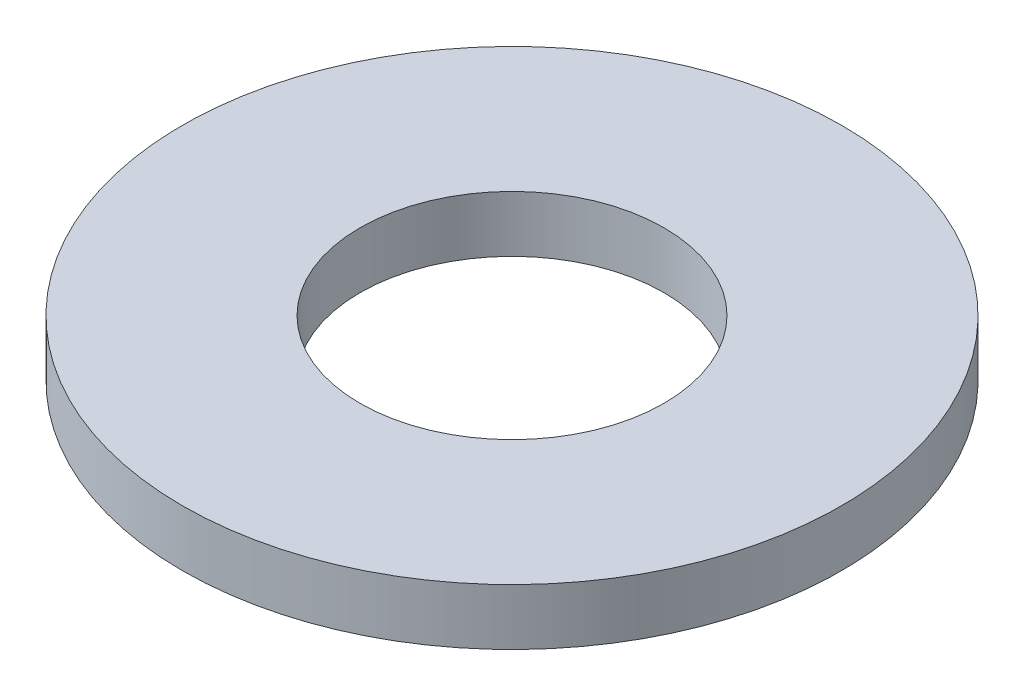
ISO-10303-21;
HEADER;
FILE_DESCRIPTION(('STEP AP214'),'2;1');
FILE_NAME('part.step','',(''),(''),'','','');
FILE_SCHEMA(('AUTOMOTIVE_DESIGN { 1 0 10303 214 1 1 1 1 }'));
ENDSEC;
DATA;
#1=APPLICATION_CONTEXT('core data for automotive mechanical design processes');
#2=APPLICATION_PROTOCOL_DEFINITION('international standard','automotive_design',2000,#1);
#3=PRODUCT_CONTEXT('',#1,'mechanical');
#4=PRODUCT('Part','Part','',(#3));
#5=PRODUCT_RELATED_PRODUCT_CATEGORY('part','',(#4));
#6=PRODUCT_DEFINITION_FORMATION('','',#4);
#7=PRODUCT_DEFINITION_CONTEXT('part definition',#1,'design');
#8=PRODUCT_DEFINITION('design','',#6,#7);
#9=PRODUCT_DEFINITION_SHAPE('','',#8);
#10=(LENGTH_UNIT() NAMED_UNIT(*) SI_UNIT(.MILLI.,.METRE.));
#11=(NAMED_UNIT(*) PLANE_ANGLE_UNIT() SI_UNIT($,.RADIAN.));
#12=(NAMED_UNIT(*) SI_UNIT($,.STERADIAN.) SOLID_ANGLE_UNIT());
#13=UNCERTAINTY_MEASURE_WITH_UNIT(LENGTH_MEASURE(1.E-05),#10,'distance_accuracy_value','');
#14=(GEOMETRIC_REPRESENTATION_CONTEXT(3) GLOBAL_UNCERTAINTY_ASSIGNED_CONTEXT((#13)) GLOBAL_UNIT_ASSIGNED_CONTEXT((#10,
#11,#12)) REPRESENTATION_CONTEXT('',''));
#15=CARTESIAN_POINT('',(0.,0.,0.));
#16=DIRECTION('',(0.,0.,1.));
#17=DIRECTION('',(1.,0.,0.));
#18=AXIS2_PLACEMENT_3D('',#15,#16,#17);
#19=CARTESIAN_POINT('',(0.,0.8128,0.));
#20=DIRECTION('',(0.,1.,0.));
#21=DIRECTION('',(0.,0.,1.));
#22=AXIS2_PLACEMENT_3D('',#19,#20,#21);
#23=PLANE('',#22);
#24=CARTESIAN_POINT('',(0.,0.8128,0.));
#25=DIRECTION('',(0.,-1.,0.));
#26=DIRECTION('',(0.,0.,-1.));
#27=AXIS2_PLACEMENT_3D('',#24,#25,#26);
#28=CIRCLE('',#27,2.1971);
#29=CARTESIAN_POINT('',(0.,0.8128,-2.1971));
#30=VERTEX_POINT('',#29);
#31=EDGE_CURVE('E25',#30,#30,#28,.T.);
#32=ORIENTED_EDGE('',*,*,#31,.T.);
#33=EDGE_LOOP('',(#32));
#34=FACE_BOUND('',#33,.T.);
#35=CARTESIAN_POINT('',(0.,0.8128,0.));
#36=DIRECTION('',(0.,-1.,0.));
#37=DIRECTION('',(0.,0.,-1.));
#38=AXIS2_PLACEMENT_3D('',#35,#36,#37);
#39=CIRCLE('',#38,4.7625);
#40=CARTESIAN_POINT('',(0.,0.8128,-4.7625));
#41=VERTEX_POINT('',#40);
#42=EDGE_CURVE('E16',#41,#41,#39,.T.);
#43=ORIENTED_EDGE('',*,*,#42,.F.);
#44=EDGE_LOOP('',(#43));
#45=FACE_BOUND('',#44,.T.);
#46=ADVANCED_FACE('F12',(#34,#45),#23,.T.);
#47=CARTESIAN_POINT('',(0.,0.8128,0.));
#48=DIRECTION('',(0.,-1.,0.));
#49=DIRECTION('',(0.,0.,-1.));
#50=AXIS2_PLACEMENT_3D('',#47,#48,#49);
#51=CYLINDRICAL_SURFACE('',#50,4.7625);
#52=ORIENTED_EDGE('',*,*,#42,.T.);
#53=EDGE_LOOP('',(#52));
#54=FACE_BOUND('',#53,.T.);
#55=CARTESIAN_POINT('',(0.,0.,0.));
#56=DIRECTION('',(0.,-1.,0.));
#57=DIRECTION('',(0.,0.,-1.));
#58=AXIS2_PLACEMENT_3D('',#55,#56,#57);
#59=CIRCLE('',#58,4.7625);
#60=CARTESIAN_POINT('',(0.,0.,-4.7625));
#61=VERTEX_POINT('',#60);
#62=EDGE_CURVE('E20',#61,#61,#59,.F.);
#63=ORIENTED_EDGE('',*,*,#62,.T.);
#64=EDGE_LOOP('',(#63));
#65=FACE_BOUND('',#64,.T.);
#66=ADVANCED_FACE('F33',(#54,#65),#51,.T.);
#67=CARTESIAN_POINT('',(0.,0.8128,0.));
#68=DIRECTION('',(0.,-1.,0.));
#69=DIRECTION('',(0.,0.,-1.));
#70=AXIS2_PLACEMENT_3D('',#67,#68,#69);
#71=CYLINDRICAL_SURFACE('',#70,2.1971);
#72=CARTESIAN_POINT('',(0.,0.,0.));
#73=DIRECTION('',(0.,-1.,0.));
#74=DIRECTION('',(0.,0.,-1.));
#75=AXIS2_PLACEMENT_3D('',#72,#73,#74);
#76=CIRCLE('',#75,2.1971);
#77=CARTESIAN_POINT('',(0.,0.,-2.1971));
#78=VERTEX_POINT('',#77);
#79=EDGE_CURVE('E8',#78,#78,#76,.T.);
#80=ORIENTED_EDGE('',*,*,#79,.T.);
#81=EDGE_LOOP('',(#80));
#82=FACE_BOUND('',#81,.T.);
#83=ORIENTED_EDGE('',*,*,#31,.F.);
#84=EDGE_LOOP('',(#83));
#85=FACE_BOUND('',#84,.T.);
#86=ADVANCED_FACE('F42',(#82,#85),#71,.F.);
#87=CARTESIAN_POINT('',(0.,0.,0.));
#88=DIRECTION('',(0.,1.,0.));
#89=DIRECTION('',(0.,0.,1.));
#90=AXIS2_PLACEMENT_3D('',#87,#88,#89);
#91=PLANE('',#90);
#92=ORIENTED_EDGE('',*,*,#79,.F.);
#93=EDGE_LOOP('',(#92));
#94=FACE_BOUND('',#93,.T.);
#95=ORIENTED_EDGE('',*,*,#62,.F.);
#96=EDGE_LOOP('',(#95));
#97=FACE_BOUND('',#96,.T.);
#98=ADVANCED_FACE('F14',(#94,#97),#91,.F.);
#99=CLOSED_SHELL('',(#46,#66,#86,#98));
#100=MANIFOLD_SOLID_BREP('B1',#99);
#101=ADVANCED_BREP_SHAPE_REPRESENTATION('',(#18,#100),#14);
#102=SHAPE_DEFINITION_REPRESENTATION(#9,#101);
ENDSEC;
END-ISO-10303-21;
